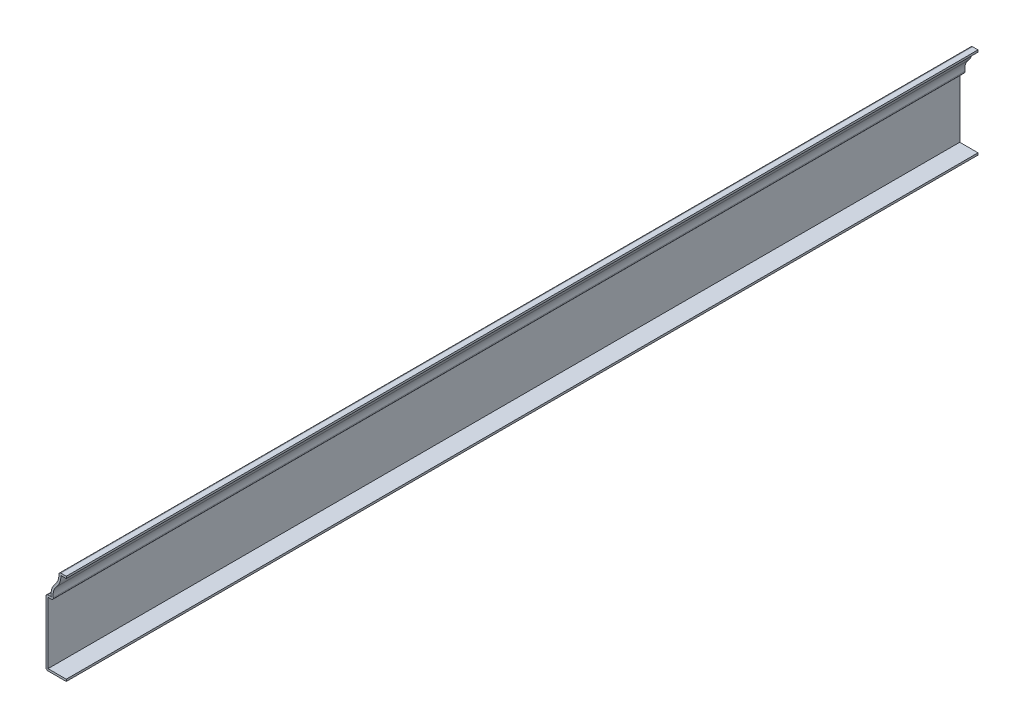
ISO-10303-21;
HEADER;
FILE_DESCRIPTION(('STEP AP214'),'2;1');
FILE_NAME('part.step','',(''),(''),'','','');
FILE_SCHEMA(('AUTOMOTIVE_DESIGN { 1 0 10303 214 1 1 1 1 }'));
ENDSEC;
DATA;
#1=APPLICATION_CONTEXT('core data for automotive mechanical design processes');
#2=APPLICATION_PROTOCOL_DEFINITION('international standard','automotive_design',2000,#1);
#3=PRODUCT_CONTEXT('',#1,'mechanical');
#4=PRODUCT('Part','Part','',(#3));
#5=PRODUCT_RELATED_PRODUCT_CATEGORY('part','',(#4));
#6=PRODUCT_DEFINITION_FORMATION('','',#4);
#7=PRODUCT_DEFINITION_CONTEXT('part definition',#1,'design');
#8=PRODUCT_DEFINITION('design','',#6,#7);
#9=PRODUCT_DEFINITION_SHAPE('','',#8);
#10=(LENGTH_UNIT() NAMED_UNIT(*) SI_UNIT(.MILLI.,.METRE.));
#11=(NAMED_UNIT(*) PLANE_ANGLE_UNIT() SI_UNIT($,.RADIAN.));
#12=(NAMED_UNIT(*) SI_UNIT($,.STERADIAN.) SOLID_ANGLE_UNIT());
#13=UNCERTAINTY_MEASURE_WITH_UNIT(LENGTH_MEASURE(1.E-05),#10,'distance_accuracy_value','');
#14=(GEOMETRIC_REPRESENTATION_CONTEXT(3) GLOBAL_UNCERTAINTY_ASSIGNED_CONTEXT((#13)) GLOBAL_UNIT_ASSIGNED_CONTEXT((#10,
#11,#12)) REPRESENTATION_CONTEXT('',''));
#15=CARTESIAN_POINT('',(0.,0.,0.));
#16=DIRECTION('',(0.,0.,1.));
#17=DIRECTION('',(1.,0.,0.));
#18=AXIS2_PLACEMENT_3D('',#15,#16,#17);
#19=CARTESIAN_POINT('',(-4.7625,55.88,-571.5));
#20=DIRECTION('',(0.,-1.,0.));
#21=DIRECTION('',(0.,0.,-1.));
#22=AXIS2_PLACEMENT_3D('',#19,#20,#21);
#23=PLANE('',#22);
#24=DIRECTION('',(1.,0.,0.));
#25=VECTOR('',#24,1.);
#26=CARTESIAN_POINT('',(-4.7625,55.88,0.));
#27=LINE('',#26,#25);
#28=CARTESIAN_POINT('',(-3.36712627516429,55.88,0.));
#29=VERTEX_POINT('',#28);
#30=CARTESIAN_POINT('',(0.,55.88,0.));
#31=VERTEX_POINT('',#30);
#32=EDGE_CURVE('E216',#29,#31,#27,.T.);
#33=ORIENTED_EDGE('',*,*,#32,.F.);
#34=DIRECTION('',(0.,0.,1.));
#35=VECTOR('',#34,1.);
#36=CARTESIAN_POINT('',(-3.36712627516429,55.88,-571.5));
#37=LINE('',#36,#35);
#38=CARTESIAN_POINT('',(-3.36712627516429,55.88,-571.5));
#39=VERTEX_POINT('',#38);
#40=EDGE_CURVE('E183',#39,#29,#37,.T.);
#41=ORIENTED_EDGE('',*,*,#40,.F.);
#42=DIRECTION('',(1.,0.,0.));
#43=VECTOR('',#42,1.);
#44=CARTESIAN_POINT('',(-4.7625,55.88,-571.5));
#45=LINE('',#44,#43);
#46=CARTESIAN_POINT('',(0.,55.88,-571.5));
#47=VERTEX_POINT('',#46);
#48=EDGE_CURVE('E165',#39,#47,#45,.T.);
#49=ORIENTED_EDGE('',*,*,#48,.T.);
#50=DIRECTION('',(0.,0.,1.));
#51=VECTOR('',#50,1.);
#52=CARTESIAN_POINT('',(0.,55.88,-571.5));
#53=LINE('',#52,#51);
#54=EDGE_CURVE('E173',#47,#31,#53,.T.);
#55=ORIENTED_EDGE('',*,*,#54,.T.);
#56=EDGE_LOOP('',(#33,#41,#49,#55));
#57=FACE_BOUND('',#56,.T.);
#58=ADVANCED_FACE('F35',(#57),#23,.T.);
#59=CARTESIAN_POINT('',(-14.1581030777393,55.5853058428001,-571.5));
#60=DIRECTION('',(0.,0.,1.));
#61=DIRECTION('',(1.,0.,0.));
#62=AXIS2_PLACEMENT_3D('',#59,#60,#61);
#63=CYLINDRICAL_SURFACE('',#62,10.795);
#64=CARTESIAN_POINT('',(-14.1581030777393,55.5853058428001,0.));
#65=DIRECTION('',(0.,0.,1.));
#66=DIRECTION('',(1.,0.,0.));
#67=AXIS2_PLACEMENT_3D('',#64,#65,#66);
#68=CIRCLE('',#67,10.795);
#69=CARTESIAN_POINT('',(-6.13517800035371,48.3627925542933,0.));
#70=VERTEX_POINT('',#69);
#71=EDGE_CURVE('E184',#70,#29,#68,.T.);
#72=ORIENTED_EDGE('',*,*,#71,.F.);
#73=DIRECTION('',(0.,0.,1.));
#74=VECTOR('',#73,1.);
#75=CARTESIAN_POINT('',(-6.13517800035371,48.3627925542933,-571.5));
#76=LINE('',#75,#74);
#77=CARTESIAN_POINT('',(-6.13517800035371,48.3627925542933,-571.5));
#78=VERTEX_POINT('',#77);
#79=EDGE_CURVE('E247',#78,#70,#76,.T.);
#80=ORIENTED_EDGE('',*,*,#79,.F.);
#81=CARTESIAN_POINT('',(-14.1581030777393,55.5853058428001,-571.5));
#82=DIRECTION('',(0.,0.,1.));
#83=DIRECTION('',(1.,0.,0.));
#84=AXIS2_PLACEMENT_3D('',#81,#82,#83);
#85=CIRCLE('',#84,10.795);
#86=EDGE_CURVE('E181',#78,#39,#85,.T.);
#87=ORIENTED_EDGE('',*,*,#86,.T.);
#88=ORIENTED_EDGE('',*,*,#40,.T.);
#89=EDGE_LOOP('',(#72,#80,#87,#88));
#90=FACE_BOUND('',#89,.T.);
#91=ADVANCED_FACE('F308',(#90),#63,.T.);
#92=CARTESIAN_POINT('',(0.,42.8396941571999,-571.5));
#93=DIRECTION('',(0.,0.,1.));
#94=DIRECTION('',(1.,0.,0.));
#95=AXIS2_PLACEMENT_3D('',#92,#93,#94);
#96=CYLINDRICAL_SURFACE('',#95,8.255);
#97=CARTESIAN_POINT('',(0.,42.8396941571999,0.));
#98=DIRECTION('',(0.,0.,1.));
#99=DIRECTION('',(1.,0.,0.));
#100=AXIS2_PLACEMENT_3D('',#97,#98,#99);
#101=CIRCLE('',#100,8.255);
#102=CARTESIAN_POINT('',(-8.14285600070741,41.4836258876267,0.));
#103=VERTEX_POINT('',#102);
#104=EDGE_CURVE('E187',#103,#70,#101,.F.);
#105=ORIENTED_EDGE('',*,*,#104,.F.);
#106=DIRECTION('',(0.,0.,1.));
#107=VECTOR('',#106,1.);
#108=CARTESIAN_POINT('',(-8.14285600070741,41.4836258876267,-571.5));
#109=LINE('',#108,#107);
#110=CARTESIAN_POINT('',(-8.14285600070741,41.4836258876267,-571.5));
#111=VERTEX_POINT('',#110);
#112=EDGE_CURVE('E290',#103,#111,#109,.F.);
#113=ORIENTED_EDGE('',*,*,#112,.T.);
#114=CARTESIAN_POINT('',(0.,42.8396941571999,-571.5));
#115=DIRECTION('',(0.,0.,1.));
#116=DIRECTION('',(1.,0.,0.));
#117=AXIS2_PLACEMENT_3D('',#114,#115,#116);
#118=CIRCLE('',#117,8.255);
#119=EDGE_CURVE('E213',#111,#78,#118,.F.);
#120=ORIENTED_EDGE('',*,*,#119,.T.);
#121=ORIENTED_EDGE('',*,*,#79,.T.);
#122=EDGE_LOOP('',(#105,#113,#120,#121));
#123=FACE_BOUND('',#122,.T.);
#124=ADVANCED_FACE('F373',(#123),#96,.F.);
#125=CARTESIAN_POINT('',(-12.7,40.005,-571.5));
#126=DIRECTION('',(0.,-1.,0.));
#127=DIRECTION('',(0.,0.,-1.));
#128=AXIS2_PLACEMENT_3D('',#125,#126,#127);
#129=PLANE('',#128);
#130=DIRECTION('',(1.,0.,0.));
#131=VECTOR('',#130,1.);
#132=CARTESIAN_POINT('',(-12.7,40.005,-571.5));
#133=LINE('',#132,#131);
#134=CARTESIAN_POINT('',(-11.43,40.005,-571.5));
#135=VERTEX_POINT('',#134);
#136=CARTESIAN_POINT('',(-9.39560307773931,40.005,-571.5));
#137=VERTEX_POINT('',#136);
#138=EDGE_CURVE('E210',#135,#137,#133,.T.);
#139=ORIENTED_EDGE('',*,*,#138,.T.);
#140=DIRECTION('',(0.,0.,1.));
#141=VECTOR('',#140,1.);
#142=CARTESIAN_POINT('',(-9.39560307773931,40.005,-571.5));
#143=LINE('',#142,#141);
#144=CARTESIAN_POINT('',(-9.39560307773931,40.005,0.));
#145=VERTEX_POINT('',#144);
#146=EDGE_CURVE('E287',#137,#145,#143,.T.);
#147=ORIENTED_EDGE('',*,*,#146,.T.);
#148=DIRECTION('',(1.,0.,0.));
#149=VECTOR('',#148,1.);
#150=CARTESIAN_POINT('',(-12.7,40.005,0.));
#151=LINE('',#150,#149);
#152=CARTESIAN_POINT('',(-11.43,40.005,0.));
#153=VERTEX_POINT('',#152);
#154=EDGE_CURVE('E241',#153,#145,#151,.T.);
#155=ORIENTED_EDGE('',*,*,#154,.F.);
#156=DIRECTION('',(0.,0.,1.));
#157=VECTOR('',#156,1.);
#158=CARTESIAN_POINT('',(-11.43,40.005,-571.5));
#159=LINE('',#158,#157);
#160=EDGE_CURVE('E250',#135,#153,#159,.T.);
#161=ORIENTED_EDGE('',*,*,#160,.F.);
#162=EDGE_LOOP('',(#139,#147,#155,#161));
#163=FACE_BOUND('',#162,.T.);
#164=ADVANCED_FACE('F319',(#163),#129,.T.);
#165=CARTESIAN_POINT('',(-11.43,0.,-571.5));
#166=DIRECTION('',(1.,0.,0.));
#167=DIRECTION('',(0.,0.,-1.));
#168=AXIS2_PLACEMENT_3D('',#165,#166,#167);
#169=PLANE('',#168);
#170=DIRECTION('',(0.,1.,0.));
#171=VECTOR('',#170,1.);
#172=CARTESIAN_POINT('',(-11.43,0.,0.));
#173=LINE('',#172,#171);
#174=CARTESIAN_POINT('',(-11.43,1.27,0.));
#175=VERTEX_POINT('',#174);
#176=EDGE_CURVE('E238',#175,#153,#173,.T.);
#177=ORIENTED_EDGE('',*,*,#176,.F.);
#178=DIRECTION('',(0.,0.,1.));
#179=VECTOR('',#178,1.);
#180=CARTESIAN_POINT('',(-11.43,1.27,-571.5));
#181=LINE('',#180,#179);
#182=CARTESIAN_POINT('',(-11.43,1.27,-571.5));
#183=VERTEX_POINT('',#182);
#184=EDGE_CURVE('E252',#183,#175,#181,.T.);
#185=ORIENTED_EDGE('',*,*,#184,.F.);
#186=DIRECTION('',(0.,1.,0.));
#187=VECTOR('',#186,1.);
#188=CARTESIAN_POINT('',(-11.43,0.,-571.5));
#189=LINE('',#188,#187);
#190=EDGE_CURVE('E207',#183,#135,#189,.T.);
#191=ORIENTED_EDGE('',*,*,#190,.T.);
#192=ORIENTED_EDGE('',*,*,#160,.T.);
#193=EDGE_LOOP('',(#177,#185,#191,#192));
#194=FACE_BOUND('',#193,.T.);
#195=ADVANCED_FACE('F324',(#194),#169,.T.);
#196=CARTESIAN_POINT('',(0.,1.27,-571.5));
#197=DIRECTION('',(0.,1.,0.));
#198=DIRECTION('',(-1.,0.,0.));
#199=AXIS2_PLACEMENT_3D('',#196,#197,#198);
#200=PLANE('',#199);
#201=DIRECTION('',(-1.,0.,0.));
#202=VECTOR('',#201,1.);
#203=CARTESIAN_POINT('',(0.,1.27,0.));
#204=LINE('',#203,#202);
#205=CARTESIAN_POINT('',(0.,1.27,0.));
#206=VERTEX_POINT('',#205);
#207=EDGE_CURVE('E235',#206,#175,#204,.T.);
#208=ORIENTED_EDGE('',*,*,#207,.F.);
#209=DIRECTION('',(0.,0.,1.));
#210=VECTOR('',#209,1.);
#211=CARTESIAN_POINT('',(0.,1.27,-571.5));
#212=LINE('',#211,#210);
#213=CARTESIAN_POINT('',(0.,1.27,-571.5));
#214=VERTEX_POINT('',#213);
#215=EDGE_CURVE('E254',#214,#206,#212,.T.);
#216=ORIENTED_EDGE('',*,*,#215,.F.);
#217=DIRECTION('',(-1.,0.,0.));
#218=VECTOR('',#217,1.);
#219=CARTESIAN_POINT('',(0.,1.27,-571.5));
#220=LINE('',#219,#218);
#221=EDGE_CURVE('E204',#214,#183,#220,.T.);
#222=ORIENTED_EDGE('',*,*,#221,.T.);
#223=ORIENTED_EDGE('',*,*,#184,.T.);
#224=EDGE_LOOP('',(#208,#216,#222,#223));
#225=FACE_BOUND('',#224,.T.);
#226=ADVANCED_FACE('F328',(#225),#200,.T.);
#227=CARTESIAN_POINT('',(0.,1.27,-571.5));
#228=DIRECTION('',(-1.,0.,0.));
#229=DIRECTION('',(0.,-1.,0.));
#230=AXIS2_PLACEMENT_3D('',#227,#228,#229);
#231=PLANE('',#230);
#232=DIRECTION('',(0.,-1.,0.));
#233=VECTOR('',#232,1.);
#234=CARTESIAN_POINT('',(0.,1.27,0.));
#235=LINE('',#234,#233);
#236=CARTESIAN_POINT('',(0.,0.,0.));
#237=VERTEX_POINT('',#236);
#238=EDGE_CURVE('E233',#206,#237,#235,.T.);
#239=ORIENTED_EDGE('',*,*,#238,.T.);
#240=DIRECTION('',(0.,0.,1.));
#241=VECTOR('',#240,1.);
#242=CARTESIAN_POINT('',(0.,0.,-571.5));
#243=LINE('',#242,#241);
#244=CARTESIAN_POINT('',(0.,0.,-571.5));
#245=VERTEX_POINT('',#244);
#246=EDGE_CURVE('E256',#245,#237,#243,.T.);
#247=ORIENTED_EDGE('',*,*,#246,.F.);
#248=DIRECTION('',(0.,-1.,0.));
#249=VECTOR('',#248,1.);
#250=CARTESIAN_POINT('',(0.,1.27,-571.5));
#251=LINE('',#250,#249);
#252=EDGE_CURVE('E202',#214,#245,#251,.T.);
#253=ORIENTED_EDGE('',*,*,#252,.F.);
#254=ORIENTED_EDGE('',*,*,#215,.T.);
#255=EDGE_LOOP('',(#239,#247,#253,#254));
#256=FACE_BOUND('',#255,.T.);
#257=ADVANCED_FACE('F332',(#256),#231,.F.);
#258=CARTESIAN_POINT('',(0.,0.,-571.5));
#259=DIRECTION('',(0.,1.,0.));
#260=DIRECTION('',(-1.,0.,0.));
#261=AXIS2_PLACEMENT_3D('',#258,#259,#260);
#262=PLANE('',#261);
#263=DIRECTION('',(-1.,0.,0.));
#264=VECTOR('',#263,1.);
#265=CARTESIAN_POINT('',(0.,0.,0.));
#266=LINE('',#265,#264);
#267=CARTESIAN_POINT('',(-11.43,0.,0.));
#268=VERTEX_POINT('',#267);
#269=EDGE_CURVE('E230',#237,#268,#266,.T.);
#270=ORIENTED_EDGE('',*,*,#269,.T.);
#271=DIRECTION('',(0.,0.,1.));
#272=VECTOR('',#271,1.);
#273=CARTESIAN_POINT('',(-11.43,0.,-571.5));
#274=LINE('',#273,#272);
#275=CARTESIAN_POINT('',(-11.43,0.,-571.5));
#276=VERTEX_POINT('',#275);
#277=EDGE_CURVE('E278',#268,#276,#274,.F.);
#278=ORIENTED_EDGE('',*,*,#277,.T.);
#279=DIRECTION('',(-1.,0.,0.));
#280=VECTOR('',#279,1.);
#281=CARTESIAN_POINT('',(0.,0.,-571.5));
#282=LINE('',#281,#280);
#283=EDGE_CURVE('E200',#245,#276,#282,.T.);
#284=ORIENTED_EDGE('',*,*,#283,.F.);
#285=ORIENTED_EDGE('',*,*,#246,.T.);
#286=EDGE_LOOP('',(#270,#278,#284,#285));
#287=FACE_BOUND('',#286,.T.);
#288=ADVANCED_FACE('F449',(#287),#262,.F.);
#289=CARTESIAN_POINT('',(-12.7,0.,-571.5));
#290=DIRECTION('',(1.,0.,0.));
#291=DIRECTION('',(0.,0.,-1.));
#292=AXIS2_PLACEMENT_3D('',#289,#290,#291);
#293=PLANE('',#292);
#294=DIRECTION('',(0.,1.,0.));
#295=VECTOR('',#294,1.);
#296=CARTESIAN_POINT('',(-12.7,0.,-571.5));
#297=LINE('',#296,#295);
#298=CARTESIAN_POINT('',(-12.7,1.27,-571.5));
#299=VERTEX_POINT('',#298);
#300=CARTESIAN_POINT('',(-12.7,40.005,-571.5));
#301=VERTEX_POINT('',#300);
#302=EDGE_CURVE('E197',#299,#301,#297,.T.);
#303=ORIENTED_EDGE('',*,*,#302,.F.);
#304=DIRECTION('',(0.,0.,1.));
#305=VECTOR('',#304,1.);
#306=CARTESIAN_POINT('',(-12.7,1.27,-571.5));
#307=LINE('',#306,#305);
#308=CARTESIAN_POINT('',(-12.7,1.27,0.));
#309=VERTEX_POINT('',#308);
#310=EDGE_CURVE('E267',#299,#309,#307,.T.);
#311=ORIENTED_EDGE('',*,*,#310,.T.);
#312=DIRECTION('',(0.,1.,0.));
#313=VECTOR('',#312,1.);
#314=CARTESIAN_POINT('',(-12.7,0.,0.));
#315=LINE('',#314,#313);
#316=CARTESIAN_POINT('',(-12.7,40.005,0.));
#317=VERTEX_POINT('',#316);
#318=EDGE_CURVE('E227',#309,#317,#315,.T.);
#319=ORIENTED_EDGE('',*,*,#318,.T.);
#320=DIRECTION('',(0.,0.,1.));
#321=VECTOR('',#320,1.);
#322=CARTESIAN_POINT('',(-12.7,40.005,-571.5));
#323=LINE('',#322,#321);
#324=EDGE_CURVE('E246',#317,#301,#323,.F.);
#325=ORIENTED_EDGE('',*,*,#324,.T.);
#326=EDGE_LOOP('',(#303,#311,#319,#325));
#327=FACE_BOUND('',#326,.T.);
#328=ADVANCED_FACE('F342',(#327),#293,.F.);
#329=CARTESIAN_POINT('',(-12.7,41.275,-571.5));
#330=DIRECTION('',(0.,-1.,0.));
#331=DIRECTION('',(0.,0.,-1.));
#332=AXIS2_PLACEMENT_3D('',#329,#330,#331);
#333=PLANE('',#332);
#334=DIRECTION('',(1.,0.,0.));
#335=VECTOR('',#334,1.);
#336=CARTESIAN_POINT('',(-12.7,41.275,-571.5));
#337=LINE('',#336,#335);
#338=CARTESIAN_POINT('',(-11.43,41.275,-571.5));
#339=VERTEX_POINT('',#338);
#340=CARTESIAN_POINT('',(-9.39560307773932,41.275,-571.5));
#341=VERTEX_POINT('',#340);
#342=EDGE_CURVE('E195',#339,#341,#337,.T.);
#343=ORIENTED_EDGE('',*,*,#342,.F.);
#344=DIRECTION('',(0.,0.,1.));
#345=VECTOR('',#344,1.);
#346=CARTESIAN_POINT('',(-11.43,41.275,-571.5));
#347=LINE('',#346,#345);
#348=CARTESIAN_POINT('',(-11.43,41.275,0.));
#349=VERTEX_POINT('',#348);
#350=EDGE_CURVE('E292',#339,#349,#347,.T.);
#351=ORIENTED_EDGE('',*,*,#350,.T.);
#352=DIRECTION('',(1.,0.,0.));
#353=VECTOR('',#352,1.);
#354=CARTESIAN_POINT('',(-12.7,41.275,0.));
#355=LINE('',#354,#353);
#356=CARTESIAN_POINT('',(-9.39560307773932,41.275,0.));
#357=VERTEX_POINT('',#356);
#358=EDGE_CURVE('E225',#349,#357,#355,.T.);
#359=ORIENTED_EDGE('',*,*,#358,.T.);
#360=DIRECTION('',(0.,0.,1.));
#361=VECTOR('',#360,1.);
#362=CARTESIAN_POINT('',(-9.39560307773932,41.275,-571.5));
#363=LINE('',#362,#361);
#364=EDGE_CURVE('E259',#341,#357,#363,.T.);
#365=ORIENTED_EDGE('',*,*,#364,.F.);
#366=EDGE_LOOP('',(#343,#351,#359,#365));
#367=FACE_BOUND('',#366,.T.);
#368=ADVANCED_FACE('F353',(#367),#333,.F.);
#369=CARTESIAN_POINT('',(0.,42.8396941571999,-571.5));
#370=DIRECTION('',(0.,0.,1.));
#371=DIRECTION('',(1.,0.,0.));
#372=AXIS2_PLACEMENT_3D('',#369,#370,#371);
#373=CYLINDRICAL_SURFACE('',#372,9.525);
#374=CARTESIAN_POINT('',(0.,42.8396941571999,0.));
#375=DIRECTION('',(0.,0.,-1.));
#376=DIRECTION('',(-1.,0.,0.));
#377=AXIS2_PLACEMENT_3D('',#374,#375,#376);
#378=CIRCLE('',#377,9.525);
#379=CARTESIAN_POINT('',(-7.07905153886966,49.2125,0.));
#380=VERTEX_POINT('',#379);
#381=EDGE_CURVE('E223',#357,#380,#378,.T.);
#382=ORIENTED_EDGE('',*,*,#381,.T.);
#383=DIRECTION('',(0.,0.,1.));
#384=VECTOR('',#383,1.);
#385=CARTESIAN_POINT('',(-7.07905153886966,49.2125,-571.5));
#386=LINE('',#385,#384);
#387=CARTESIAN_POINT('',(-7.07905153886966,49.2125,-571.5));
#388=VERTEX_POINT('',#387);
#389=EDGE_CURVE('E262',#388,#380,#386,.T.);
#390=ORIENTED_EDGE('',*,*,#389,.F.);
#391=CARTESIAN_POINT('',(0.,42.8396941571999,-571.5));
#392=DIRECTION('',(0.,0.,-1.));
#393=DIRECTION('',(-1.,0.,0.));
#394=AXIS2_PLACEMENT_3D('',#391,#392,#393);
#395=CIRCLE('',#394,9.525);
#396=EDGE_CURVE('E193',#341,#388,#395,.T.);
#397=ORIENTED_EDGE('',*,*,#396,.F.);
#398=ORIENTED_EDGE('',*,*,#364,.T.);
#399=EDGE_LOOP('',(#382,#390,#397,#398));
#400=FACE_BOUND('',#399,.T.);
#401=ADVANCED_FACE('F358',(#400),#373,.T.);
#402=CARTESIAN_POINT('',(-14.1581030777393,55.5853058428001,-571.5));
#403=DIRECTION('',(0.,0.,1.));
#404=DIRECTION('',(1.,0.,0.));
#405=AXIS2_PLACEMENT_3D('',#402,#403,#404);
#406=CYLINDRICAL_SURFACE('',#405,9.525);
#407=CARTESIAN_POINT('',(-14.1581030777393,55.5853058428001,0.));
#408=DIRECTION('',(0.,0.,1.));
#409=DIRECTION('',(1.,0.,0.));
#410=AXIS2_PLACEMENT_3D('',#407,#408,#409);
#411=CIRCLE('',#410,9.525);
#412=CARTESIAN_POINT('',(-4.63665295782018,55.845330099153,0.));
#413=VERTEX_POINT('',#412);
#414=EDGE_CURVE('E221',#380,#413,#411,.T.);
#415=ORIENTED_EDGE('',*,*,#414,.T.);
#416=DIRECTION('',(0.,0.,1.));
#417=VECTOR('',#416,1.);
#418=CARTESIAN_POINT('',(-4.63665295782017,55.845330099153,-571.5));
#419=LINE('',#418,#417);
#420=CARTESIAN_POINT('',(-4.63665295782018,55.845330099153,-571.5));
#421=VERTEX_POINT('',#420);
#422=EDGE_CURVE('E11',#413,#421,#419,.F.);
#423=ORIENTED_EDGE('',*,*,#422,.T.);
#424=CARTESIAN_POINT('',(-14.1581030777393,55.5853058428001,-571.5));
#425=DIRECTION('',(0.,0.,1.));
#426=DIRECTION('',(1.,0.,0.));
#427=AXIS2_PLACEMENT_3D('',#424,#425,#426);
#428=CIRCLE('',#427,9.525);
#429=EDGE_CURVE('E191',#388,#421,#428,.T.);
#430=ORIENTED_EDGE('',*,*,#429,.F.);
#431=ORIENTED_EDGE('',*,*,#389,.T.);
#432=EDGE_LOOP('',(#415,#423,#430,#431));
#433=FACE_BOUND('',#432,.T.);
#434=ADVANCED_FACE('F359',(#433),#406,.F.);
#435=CARTESIAN_POINT('',(-4.7625,57.15,-571.5));
#436=DIRECTION('',(0.,-1.,0.));
#437=DIRECTION('',(0.,0.,-1.));
#438=AXIS2_PLACEMENT_3D('',#435,#436,#437);
#439=PLANE('',#438);
#440=DIRECTION('',(1.,0.,0.));
#441=VECTOR('',#440,1.);
#442=CARTESIAN_POINT('',(-4.7625,57.15,-571.5));
#443=LINE('',#442,#441);
#444=CARTESIAN_POINT('',(-3.36712627516429,57.15,-571.5));
#445=VERTEX_POINT('',#444);
#446=CARTESIAN_POINT('',(0.,57.15,-571.5));
#447=VERTEX_POINT('',#446);
#448=EDGE_CURVE('E167',#445,#447,#443,.T.);
#449=ORIENTED_EDGE('',*,*,#448,.F.);
#450=DIRECTION('',(0.,0.,1.));
#451=VECTOR('',#450,1.);
#452=CARTESIAN_POINT('',(-3.36712627516429,57.15,-571.5));
#453=LINE('',#452,#451);
#454=CARTESIAN_POINT('',(-3.36712627516429,57.15,0.));
#455=VERTEX_POINT('',#454);
#456=EDGE_CURVE('E43',#445,#455,#453,.T.);
#457=ORIENTED_EDGE('',*,*,#456,.T.);
#458=DIRECTION('',(1.,0.,0.));
#459=VECTOR('',#458,1.);
#460=CARTESIAN_POINT('',(-4.7625,57.15,0.));
#461=LINE('',#460,#459);
#462=CARTESIAN_POINT('',(0.,57.15,0.));
#463=VERTEX_POINT('',#462);
#464=EDGE_CURVE('E219',#455,#463,#461,.T.);
#465=ORIENTED_EDGE('',*,*,#464,.T.);
#466=DIRECTION('',(0.,0.,1.));
#467=VECTOR('',#466,1.);
#468=CARTESIAN_POINT('',(0.,57.15,-571.5));
#469=LINE('',#468,#467);
#470=EDGE_CURVE('E180',#447,#463,#469,.T.);
#471=ORIENTED_EDGE('',*,*,#470,.F.);
#472=EDGE_LOOP('',(#449,#457,#465,#471));
#473=FACE_BOUND('',#472,.T.);
#474=ADVANCED_FACE('F298',(#473),#439,.F.);
#475=CARTESIAN_POINT('',(0.,57.15,-571.5));
#476=DIRECTION('',(-1.,0.,0.));
#477=DIRECTION('',(0.,0.,1.));
#478=AXIS2_PLACEMENT_3D('',#475,#476,#477);
#479=PLANE('',#478);
#480=DIRECTION('',(0.,-1.,0.));
#481=VECTOR('',#480,1.);
#482=CARTESIAN_POINT('',(0.,57.15,0.));
#483=LINE('',#482,#481);
#484=EDGE_CURVE('E176',#463,#31,#483,.T.);
#485=ORIENTED_EDGE('',*,*,#484,.T.);
#486=ORIENTED_EDGE('',*,*,#54,.F.);
#487=DIRECTION('',(0.,-1.,0.));
#488=VECTOR('',#487,1.);
#489=CARTESIAN_POINT('',(0.,57.15,-571.5));
#490=LINE('',#489,#488);
#491=EDGE_CURVE('E159',#447,#47,#490,.T.);
#492=ORIENTED_EDGE('',*,*,#491,.F.);
#493=ORIENTED_EDGE('',*,*,#470,.T.);
#494=EDGE_LOOP('',(#485,#486,#492,#493));
#495=FACE_BOUND('',#494,.T.);
#496=ADVANCED_FACE('F174',(#495),#479,.F.);
#497=CARTESIAN_POINT('',(-14.1581030777393,55.5853058428001,-571.5));
#498=DIRECTION('',(0.,0.,1.));
#499=DIRECTION('',(1.,0.,0.));
#500=AXIS2_PLACEMENT_3D('',#497,#498,#499);
#501=PLANE('',#500);
#502=ORIENTED_EDGE('',*,*,#283,.T.);
#503=CARTESIAN_POINT('',(-11.43,1.27,-571.5));
#504=DIRECTION('',(0.,0.,1.));
#505=DIRECTION('',(1.,0.,0.));
#506=AXIS2_PLACEMENT_3D('',#503,#504,#505);
#507=CIRCLE('',#506,1.27);
#508=EDGE_CURVE('E285',#276,#299,#507,.F.);
#509=ORIENTED_EDGE('',*,*,#508,.T.);
#510=ORIENTED_EDGE('',*,*,#302,.T.);
#511=CARTESIAN_POINT('',(-11.43,40.005,-571.5));
#512=DIRECTION('',(0.,0.,1.));
#513=DIRECTION('',(1.,0.,0.));
#514=AXIS2_PLACEMENT_3D('',#511,#512,#513);
#515=CIRCLE('',#514,1.27);
#516=EDGE_CURVE('E281',#301,#339,#515,.F.);
#517=ORIENTED_EDGE('',*,*,#516,.T.);
#518=ORIENTED_EDGE('',*,*,#342,.T.);
#519=ORIENTED_EDGE('',*,*,#396,.T.);
#520=ORIENTED_EDGE('',*,*,#429,.T.);
#521=CARTESIAN_POINT('',(-3.36712627516429,55.88,-571.5));
#522=DIRECTION('',(0.,0.,1.));
#523=DIRECTION('',(1.,0.,0.));
#524=AXIS2_PLACEMENT_3D('',#521,#522,#523);
#525=CIRCLE('',#524,1.27);
#526=EDGE_CURVE('E50',#421,#445,#525,.F.);
#527=ORIENTED_EDGE('',*,*,#526,.T.);
#528=ORIENTED_EDGE('',*,*,#448,.T.);
#529=ORIENTED_EDGE('',*,*,#491,.T.);
#530=ORIENTED_EDGE('',*,*,#48,.F.);
#531=ORIENTED_EDGE('',*,*,#86,.F.);
#532=ORIENTED_EDGE('',*,*,#119,.F.);
#533=CARTESIAN_POINT('',(-9.39560307773931,41.275,-571.5));
#534=DIRECTION('',(0.,0.,1.));
#535=DIRECTION('',(1.,0.,0.));
#536=AXIS2_PLACEMENT_3D('',#533,#534,#535);
#537=CIRCLE('',#536,1.27);
#538=EDGE_CURVE('E283',#111,#137,#537,.F.);
#539=ORIENTED_EDGE('',*,*,#538,.T.);
#540=ORIENTED_EDGE('',*,*,#138,.F.);
#541=ORIENTED_EDGE('',*,*,#190,.F.);
#542=ORIENTED_EDGE('',*,*,#221,.F.);
#543=ORIENTED_EDGE('',*,*,#252,.T.);
#544=EDGE_LOOP('',(#502,#509,#510,#517,#518,#519,#520,#527,#528,#529,#530,#531,#532,#539,#540,
#541,#542,#543));
#545=FACE_BOUND('',#544,.T.);
#546=ADVANCED_FACE('F162',(#545),#501,.F.);
#547=CARTESIAN_POINT('',(-14.1581030777393,55.5853058428001,0.));
#548=DIRECTION('',(0.,0.,1.));
#549=DIRECTION('',(1.,0.,0.));
#550=AXIS2_PLACEMENT_3D('',#547,#548,#549);
#551=PLANE('',#550);
#552=ORIENTED_EDGE('',*,*,#318,.F.);
#553=CARTESIAN_POINT('',(-11.43,1.27,0.));
#554=DIRECTION('',(0.,0.,1.));
#555=DIRECTION('',(1.,0.,0.));
#556=AXIS2_PLACEMENT_3D('',#553,#554,#555);
#557=CIRCLE('',#556,1.27);
#558=EDGE_CURVE('E276',#309,#268,#557,.T.);
#559=ORIENTED_EDGE('',*,*,#558,.T.);
#560=ORIENTED_EDGE('',*,*,#269,.F.);
#561=ORIENTED_EDGE('',*,*,#238,.F.);
#562=ORIENTED_EDGE('',*,*,#207,.T.);
#563=ORIENTED_EDGE('',*,*,#176,.T.);
#564=ORIENTED_EDGE('',*,*,#154,.T.);
#565=CARTESIAN_POINT('',(-9.39560307773931,41.275,0.));
#566=DIRECTION('',(0.,0.,1.));
#567=DIRECTION('',(1.,0.,0.));
#568=AXIS2_PLACEMENT_3D('',#565,#566,#567);
#569=CIRCLE('',#568,1.27);
#570=EDGE_CURVE('E274',#145,#103,#569,.T.);
#571=ORIENTED_EDGE('',*,*,#570,.T.);
#572=ORIENTED_EDGE('',*,*,#104,.T.);
#573=ORIENTED_EDGE('',*,*,#71,.T.);
#574=ORIENTED_EDGE('',*,*,#32,.T.);
#575=ORIENTED_EDGE('',*,*,#484,.F.);
#576=ORIENTED_EDGE('',*,*,#464,.F.);
#577=CARTESIAN_POINT('',(-3.36712627516429,55.88,0.));
#578=DIRECTION('',(0.,0.,1.));
#579=DIRECTION('',(1.,0.,0.));
#580=AXIS2_PLACEMENT_3D('',#577,#578,#579);
#581=CIRCLE('',#580,1.27);
#582=EDGE_CURVE('E270',#455,#413,#581,.T.);
#583=ORIENTED_EDGE('',*,*,#582,.T.);
#584=ORIENTED_EDGE('',*,*,#414,.F.);
#585=ORIENTED_EDGE('',*,*,#381,.F.);
#586=ORIENTED_EDGE('',*,*,#358,.F.);
#587=CARTESIAN_POINT('',(-11.43,40.005,0.));
#588=DIRECTION('',(0.,0.,1.));
#589=DIRECTION('',(1.,0.,0.));
#590=AXIS2_PLACEMENT_3D('',#587,#588,#589);
#591=CIRCLE('',#590,1.27);
#592=EDGE_CURVE('E272',#349,#317,#591,.T.);
#593=ORIENTED_EDGE('',*,*,#592,.T.);
#594=EDGE_LOOP('',(#552,#559,#560,#561,#562,#563,#564,#571,#572,#573,#574,#575,#576,#583,#584,
#585,#586,#593));
#595=FACE_BOUND('',#594,.T.);
#596=ADVANCED_FACE('F302',(#595),#551,.T.);
#597=CARTESIAN_POINT('',(-11.43,1.27,-571.5));
#598=DIRECTION('',(0.,0.,1.));
#599=DIRECTION('',(1.,0.,0.));
#600=AXIS2_PLACEMENT_3D('',#597,#598,#599);
#601=CYLINDRICAL_SURFACE('',#600,1.27);
#602=ORIENTED_EDGE('',*,*,#508,.F.);
#603=ORIENTED_EDGE('',*,*,#277,.F.);
#604=ORIENTED_EDGE('',*,*,#558,.F.);
#605=ORIENTED_EDGE('',*,*,#310,.F.);
#606=EDGE_LOOP('',(#602,#603,#604,#605));
#607=FACE_BOUND('',#606,.T.);
#608=ADVANCED_FACE('F340',(#607),#601,.T.);
#609=CARTESIAN_POINT('',(-9.39560307773931,41.275,-571.5));
#610=DIRECTION('',(0.,0.,1.));
#611=DIRECTION('',(1.,0.,0.));
#612=AXIS2_PLACEMENT_3D('',#609,#610,#611);
#613=CYLINDRICAL_SURFACE('',#612,1.27);
#614=ORIENTED_EDGE('',*,*,#538,.F.);
#615=ORIENTED_EDGE('',*,*,#112,.F.);
#616=ORIENTED_EDGE('',*,*,#570,.F.);
#617=ORIENTED_EDGE('',*,*,#146,.F.);
#618=EDGE_LOOP('',(#614,#615,#616,#617));
#619=FACE_BOUND('',#618,.T.);
#620=ADVANCED_FACE('F316',(#619),#613,.T.);
#621=CARTESIAN_POINT('',(-11.43,40.005,-571.5));
#622=DIRECTION('',(0.,0.,1.));
#623=DIRECTION('',(1.,0.,0.));
#624=AXIS2_PLACEMENT_3D('',#621,#622,#623);
#625=CYLINDRICAL_SURFACE('',#624,1.27);
#626=ORIENTED_EDGE('',*,*,#516,.F.);
#627=ORIENTED_EDGE('',*,*,#324,.F.);
#628=ORIENTED_EDGE('',*,*,#592,.F.);
#629=ORIENTED_EDGE('',*,*,#350,.F.);
#630=EDGE_LOOP('',(#626,#627,#628,#629));
#631=FACE_BOUND('',#630,.T.);
#632=ADVANCED_FACE('F350',(#631),#625,.T.);
#633=CARTESIAN_POINT('',(-3.36712627516429,55.88,-571.5));
#634=DIRECTION('',(0.,0.,1.));
#635=DIRECTION('',(1.,0.,0.));
#636=AXIS2_PLACEMENT_3D('',#633,#634,#635);
#637=CYLINDRICAL_SURFACE('',#636,1.27);
#638=ORIENTED_EDGE('',*,*,#526,.F.);
#639=ORIENTED_EDGE('',*,*,#422,.F.);
#640=ORIENTED_EDGE('',*,*,#582,.F.);
#641=ORIENTED_EDGE('',*,*,#456,.F.);
#642=EDGE_LOOP('',(#638,#639,#640,#641));
#643=FACE_BOUND('',#642,.T.);
#644=ADVANCED_FACE('F37',(#643),#637,.T.);
#645=CLOSED_SHELL('',(#58,#91,#124,#164,#195,#226,#257,#288,#328,#368,#401,#434,#474,#496,#546,
#596,#608,#620,#632,#644));
#646=MANIFOLD_SOLID_BREP('B2',#645);
#647=ADVANCED_BREP_SHAPE_REPRESENTATION('',(#18,#646),#14);
#648=SHAPE_DEFINITION_REPRESENTATION(#9,#647);
ENDSEC;
END-ISO-10303-21;
